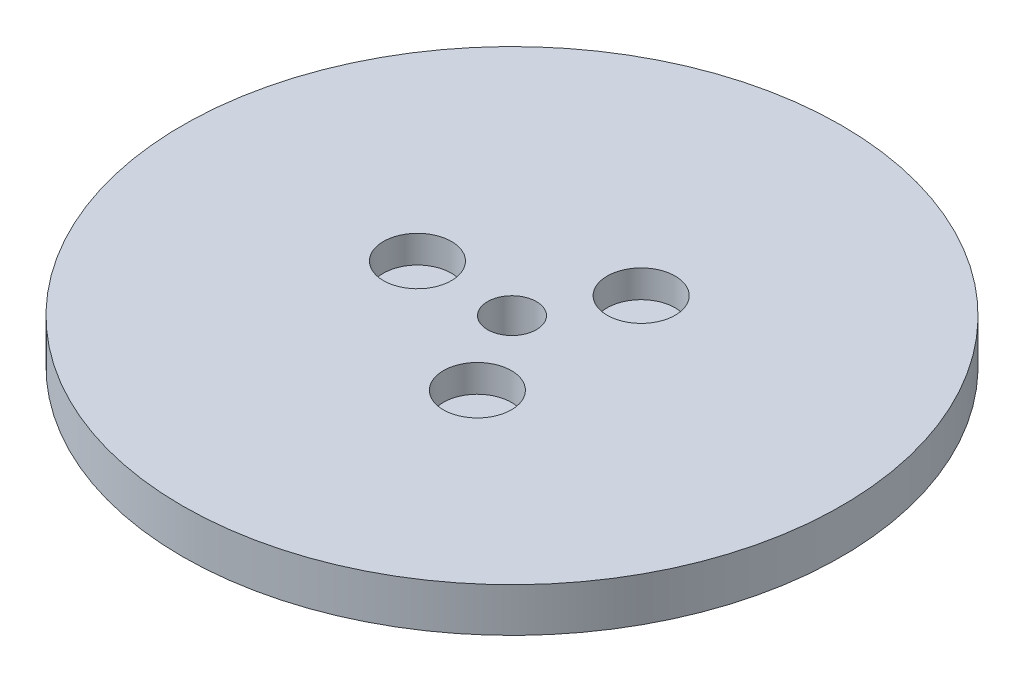
ISO-10303-21;
HEADER;
FILE_DESCRIPTION(('STEP AP214'),'2;1');
FILE_NAME('part.step','',(''),(''),'','','');
FILE_SCHEMA(('AUTOMOTIVE_DESIGN { 1 0 10303 214 1 1 1 1 }'));
ENDSEC;
DATA;
#1=APPLICATION_CONTEXT('core data for automotive mechanical design processes');
#2=APPLICATION_PROTOCOL_DEFINITION('international standard','automotive_design',2000,#1);
#3=PRODUCT_CONTEXT('',#1,'mechanical');
#4=PRODUCT('Part','Part','',(#3));
#5=PRODUCT_RELATED_PRODUCT_CATEGORY('part','',(#4));
#6=PRODUCT_DEFINITION_FORMATION('','',#4);
#7=PRODUCT_DEFINITION_CONTEXT('part definition',#1,'design');
#8=PRODUCT_DEFINITION('design','',#6,#7);
#9=PRODUCT_DEFINITION_SHAPE('','',#8);
#10=(LENGTH_UNIT() NAMED_UNIT(*) SI_UNIT(.MILLI.,.METRE.));
#11=(NAMED_UNIT(*) PLANE_ANGLE_UNIT() SI_UNIT($,.RADIAN.));
#12=(NAMED_UNIT(*) SI_UNIT($,.STERADIAN.) SOLID_ANGLE_UNIT());
#13=UNCERTAINTY_MEASURE_WITH_UNIT(LENGTH_MEASURE(1.E-05),#10,'distance_accuracy_value','');
#14=(GEOMETRIC_REPRESENTATION_CONTEXT(3) GLOBAL_UNCERTAINTY_ASSIGNED_CONTEXT((#13)) GLOBAL_UNIT_ASSIGNED_CONTEXT((#10,
#11,#12)) REPRESENTATION_CONTEXT('',''));
#15=CARTESIAN_POINT('',(0.,0.,0.));
#16=DIRECTION('',(0.,0.,1.));
#17=DIRECTION('',(1.,0.,0.));
#18=AXIS2_PLACEMENT_3D('',#15,#16,#17);
#19=CARTESIAN_POINT('',(0.,9.,0.));
#20=DIRECTION('',(0.,-1.,0.));
#21=DIRECTION('',(0.,0.,-1.));
#22=AXIS2_PLACEMENT_3D('',#19,#20,#21);
#23=CYLINDRICAL_SURFACE('',#22,67.5);
#24=CARTESIAN_POINT('',(0.,9.,0.));
#25=DIRECTION('',(0.,1.,0.));
#26=DIRECTION('',(0.,0.,1.));
#27=AXIS2_PLACEMENT_3D('',#24,#25,#26);
#28=CIRCLE('',#27,67.5);
#29=CARTESIAN_POINT('',(0.,9.,67.5));
#30=VERTEX_POINT('',#29);
#31=EDGE_CURVE('E10',#30,#30,#28,.T.);
#32=ORIENTED_EDGE('',*,*,#31,.F.);
#33=EDGE_LOOP('',(#32));
#34=FACE_BOUND('',#33,.T.);
#35=CARTESIAN_POINT('',(0.,0.,0.));
#36=DIRECTION('',(0.,1.,0.));
#37=DIRECTION('',(0.,0.,1.));
#38=AXIS2_PLACEMENT_3D('',#35,#36,#37);
#39=CIRCLE('',#38,67.5);
#40=CARTESIAN_POINT('',(0.,0.,67.5));
#41=VERTEX_POINT('',#40);
#42=EDGE_CURVE('E37',#41,#41,#39,.T.);
#43=ORIENTED_EDGE('',*,*,#42,.T.);
#44=EDGE_LOOP('',(#43));
#45=FACE_BOUND('',#44,.T.);
#46=ADVANCED_FACE('F40',(#34,#45),#23,.T.);
#47=CARTESIAN_POINT('',(0.,9.,0.));
#48=DIRECTION('',(0.,1.,0.));
#49=DIRECTION('',(0.,0.,1.));
#50=AXIS2_PLACEMENT_3D('',#47,#48,#49);
#51=PLANE('',#50);
#52=CARTESIAN_POINT('',(9.68456829909467,9.,16.7741643434027));
#53=DIRECTION('',(0.,1.,0.));
#54=DIRECTION('',(0.866025403784436,0.,-0.500000000000004));
#55=AXIS2_PLACEMENT_3D('',#52,#53,#54);
#56=CIRCLE('',#55,6.96307156261801);
#57=CARTESIAN_POINT('',(15.7147651606909,9.,13.2926285620937));
#58=VERTEX_POINT('',#57);
#59=EDGE_CURVE('E70',#58,#58,#56,.T.);
#60=ORIENTED_EDGE('',*,*,#59,.F.);
#61=EDGE_LOOP('',(#60));
#62=FACE_BOUND('',#61,.T.);
#63=CARTESIAN_POINT('',(9.68456829909443,9.,-16.7741643434028));
#64=DIRECTION('',(0.,1.,0.));
#65=DIRECTION('',(-0.866025403784443,0.,-0.499999999999992));
#66=AXIS2_PLACEMENT_3D('',#63,#64,#65);
#67=CIRCLE('',#66,6.96307156261801);
#68=CARTESIAN_POINT('',(3.6543714374982,9.,-20.2557001247118));
#69=VERTEX_POINT('',#68);
#70=EDGE_CURVE('E61',#69,#69,#67,.T.);
#71=ORIENTED_EDGE('',*,*,#70,.F.);
#72=EDGE_LOOP('',(#71));
#73=FACE_BOUND('',#72,.T.);
#74=CARTESIAN_POINT('',(-19.3691365981892,9.,0.));
#75=DIRECTION('',(0.,1.,0.));
#76=DIRECTION('',(0.,0.,1.));
#77=AXIS2_PLACEMENT_3D('',#74,#75,#76);
#78=CIRCLE('',#77,6.96307156261801);
#79=CARTESIAN_POINT('',(-19.3691365981892,9.,6.96307156261801));
#80=VERTEX_POINT('',#79);
#81=EDGE_CURVE('E54',#80,#80,#78,.T.);
#82=ORIENTED_EDGE('',*,*,#81,.F.);
#83=EDGE_LOOP('',(#82));
#84=FACE_BOUND('',#83,.T.);
#85=CARTESIAN_POINT('',(0.,9.,0.));
#86=DIRECTION('',(0.,1.,0.));
#87=DIRECTION('',(0.,0.,1.));
#88=AXIS2_PLACEMENT_3D('',#85,#86,#87);
#89=CIRCLE('',#88,5.);
#90=CARTESIAN_POINT('',(0.,9.,5.));
#91=VERTEX_POINT('',#90);
#92=EDGE_CURVE('E50',#91,#91,#89,.T.);
#93=ORIENTED_EDGE('',*,*,#92,.F.);
#94=EDGE_LOOP('',(#93));
#95=FACE_BOUND('',#94,.T.);
#96=ORIENTED_EDGE('',*,*,#31,.T.);
#97=EDGE_LOOP('',(#96));
#98=FACE_BOUND('',#97,.T.);
#99=ADVANCED_FACE('F85',(#62,#73,#84,#95,#98),#51,.T.);
#100=CARTESIAN_POINT('',(0.,0.,0.));
#101=DIRECTION('',(0.,1.,0.));
#102=DIRECTION('',(0.,0.,1.));
#103=AXIS2_PLACEMENT_3D('',#100,#101,#102);
#104=PLANE('',#103);
#105=CARTESIAN_POINT('',(0.,0.,0.));
#106=DIRECTION('',(0.,1.,0.));
#107=DIRECTION('',(0.,0.,1.));
#108=AXIS2_PLACEMENT_3D('',#105,#106,#107);
#109=CIRCLE('',#108,5.);
#110=CARTESIAN_POINT('',(0.,0.,5.));
#111=VERTEX_POINT('',#110);
#112=EDGE_CURVE('E47',#111,#111,#109,.T.);
#113=ORIENTED_EDGE('',*,*,#112,.T.);
#114=EDGE_LOOP('',(#113));
#115=FACE_BOUND('',#114,.T.);
#116=ORIENTED_EDGE('',*,*,#42,.F.);
#117=EDGE_LOOP('',(#116));
#118=FACE_BOUND('',#117,.T.);
#119=ADVANCED_FACE('F84',(#115,#118),#104,.F.);
#120=CARTESIAN_POINT('',(0.,9.,0.));
#121=DIRECTION('',(0.,-1.,0.));
#122=DIRECTION('',(0.,0.,-1.));
#123=AXIS2_PLACEMENT_3D('',#120,#121,#122);
#124=CYLINDRICAL_SURFACE('',#123,5.);
#125=ORIENTED_EDGE('',*,*,#92,.T.);
#126=EDGE_LOOP('',(#125));
#127=FACE_BOUND('',#126,.T.);
#128=ORIENTED_EDGE('',*,*,#112,.F.);
#129=EDGE_LOOP('',(#128));
#130=FACE_BOUND('',#129,.T.);
#131=ADVANCED_FACE('F91',(#127,#130),#124,.F.);
#132=CARTESIAN_POINT('',(-19.3691365981892,3.36422396896772,0.));
#133=DIRECTION('',(0.,1.,0.));
#134=DIRECTION('',(0.,0.,1.));
#135=AXIS2_PLACEMENT_3D('',#132,#133,#134);
#136=CYLINDRICAL_SURFACE('',#135,6.96307156261801);
#137=CARTESIAN_POINT('',(-19.3691365981892,3.36422396896772,0.));
#138=DIRECTION('',(0.,1.,0.));
#139=DIRECTION('',(0.,0.,1.));
#140=AXIS2_PLACEMENT_3D('',#137,#138,#139);
#141=CIRCLE('',#140,6.96307156261801);
#142=CARTESIAN_POINT('',(-19.3691365981892,3.36422396896772,6.96307156261801));
#143=VERTEX_POINT('',#142);
#144=EDGE_CURVE('E55',#143,#143,#141,.T.);
#145=ORIENTED_EDGE('',*,*,#144,.F.);
#146=EDGE_LOOP('',(#145));
#147=FACE_BOUND('',#146,.T.);
#148=ORIENTED_EDGE('',*,*,#81,.T.);
#149=EDGE_LOOP('',(#148));
#150=FACE_BOUND('',#149,.T.);
#151=ADVANCED_FACE('F96',(#147,#150),#136,.F.);
#152=CARTESIAN_POINT('',(-19.3691365981892,3.36422396896772,0.));
#153=DIRECTION('',(0.,1.,0.));
#154=DIRECTION('',(0.,0.,1.));
#155=AXIS2_PLACEMENT_3D('',#152,#153,#154);
#156=PLANE('',#155);
#157=ORIENTED_EDGE('',*,*,#144,.T.);
#158=EDGE_LOOP('',(#157));
#159=FACE_BOUND('',#158,.T.);
#160=ADVANCED_FACE('F127',(#159),#156,.T.);
#161=CARTESIAN_POINT('',(9.68456829909443,3.36422396896772,-16.7741643434028));
#162=DIRECTION('',(0.,1.,0.));
#163=DIRECTION('',(0.,0.,1.));
#164=AXIS2_PLACEMENT_3D('',#161,#162,#163);
#165=CYLINDRICAL_SURFACE('',#164,6.96307156261801);
#166=CARTESIAN_POINT('',(9.68456829909443,3.36422396896772,-16.7741643434028));
#167=DIRECTION('',(0.,1.,0.));
#168=DIRECTION('',(-0.866025403784443,0.,-0.499999999999992));
#169=AXIS2_PLACEMENT_3D('',#166,#167,#168);
#170=CIRCLE('',#169,6.96307156261801);
#171=CARTESIAN_POINT('',(3.6543714374982,3.36422396896772,-20.2557001247118));
#172=VERTEX_POINT('',#171);
#173=EDGE_CURVE('E63',#172,#172,#170,.T.);
#174=ORIENTED_EDGE('',*,*,#173,.F.);
#175=EDGE_LOOP('',(#174));
#176=FACE_BOUND('',#175,.T.);
#177=ORIENTED_EDGE('',*,*,#70,.T.);
#178=EDGE_LOOP('',(#177));
#179=FACE_BOUND('',#178,.T.);
#180=ADVANCED_FACE('F133',(#176,#179),#165,.F.);
#181=CARTESIAN_POINT('',(9.68456829909443,3.36422396896772,-16.7741643434028));
#182=DIRECTION('',(0.,1.,0.));
#183=DIRECTION('',(-0.866025403784443,0.,-0.499999999999992));
#184=AXIS2_PLACEMENT_3D('',#181,#182,#183);
#185=PLANE('',#184);
#186=ORIENTED_EDGE('',*,*,#173,.T.);
#187=EDGE_LOOP('',(#186));
#188=FACE_BOUND('',#187,.T.);
#189=ADVANCED_FACE('F77',(#188),#185,.T.);
#190=CARTESIAN_POINT('',(9.68456829909467,3.36422396896772,16.7741643434027));
#191=DIRECTION('',(0.,1.,0.));
#192=DIRECTION('',(0.,0.,1.));
#193=AXIS2_PLACEMENT_3D('',#190,#191,#192);
#194=CYLINDRICAL_SURFACE('',#193,6.96307156261801);
#195=CARTESIAN_POINT('',(9.68456829909467,3.36422396896772,16.7741643434027));
#196=DIRECTION('',(0.,1.,0.));
#197=DIRECTION('',(0.866025403784436,0.,-0.500000000000004));
#198=AXIS2_PLACEMENT_3D('',#195,#196,#197);
#199=CIRCLE('',#198,6.96307156261801);
#200=CARTESIAN_POINT('',(15.7147651606909,3.36422396896772,13.2926285620937));
#201=VERTEX_POINT('',#200);
#202=EDGE_CURVE('E59',#201,#201,#199,.T.);
#203=ORIENTED_EDGE('',*,*,#202,.F.);
#204=EDGE_LOOP('',(#203));
#205=FACE_BOUND('',#204,.T.);
#206=ORIENTED_EDGE('',*,*,#59,.T.);
#207=EDGE_LOOP('',(#206));
#208=FACE_BOUND('',#207,.T.);
#209=ADVANCED_FACE('F73',(#205,#208),#194,.F.);
#210=CARTESIAN_POINT('',(9.68456829909467,3.36422396896772,16.7741643434027));
#211=DIRECTION('',(0.,1.,0.));
#212=DIRECTION('',(0.866025403784436,0.,-0.500000000000004));
#213=AXIS2_PLACEMENT_3D('',#210,#211,#212);
#214=PLANE('',#213);
#215=ORIENTED_EDGE('',*,*,#202,.T.);
#216=EDGE_LOOP('',(#215));
#217=FACE_BOUND('',#216,.T.);
#218=ADVANCED_FACE('F71',(#217),#214,.T.);
#219=CLOSED_SHELL('',(#46,#99,#119,#131,#151,#160,#180,#189,#209,#218));
#220=MANIFOLD_SOLID_BREP('B2',#219);
#221=ADVANCED_BREP_SHAPE_REPRESENTATION('',(#18,#220),#14);
#222=SHAPE_DEFINITION_REPRESENTATION(#9,#221);
ENDSEC;
END-ISO-10303-21;
